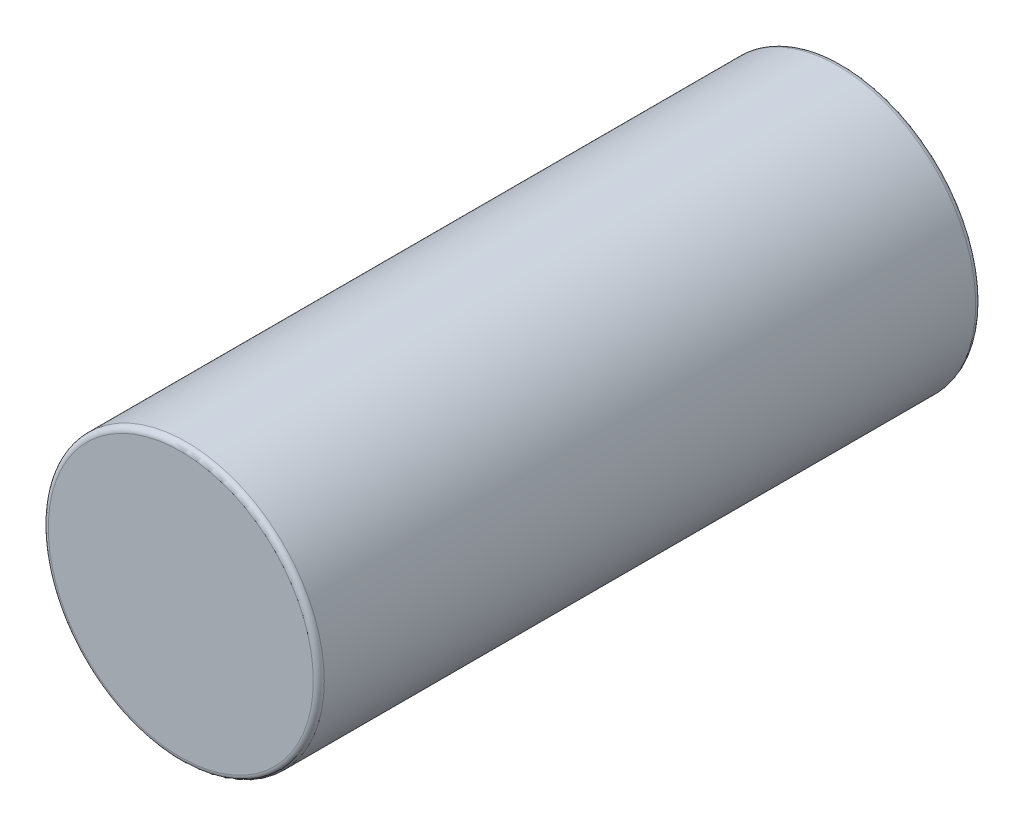
ISO-10303-21;
HEADER;
FILE_DESCRIPTION(('STEP AP214'),'2;1');
FILE_NAME('part.step','',(''),(''),'','','');
FILE_SCHEMA(('AUTOMOTIVE_DESIGN { 1 0 10303 214 1 1 1 1 }'));
ENDSEC;
DATA;
#1=APPLICATION_CONTEXT('core data for automotive mechanical design processes');
#2=APPLICATION_PROTOCOL_DEFINITION('international standard','automotive_design',2000,#1);
#3=PRODUCT_CONTEXT('',#1,'mechanical');
#4=PRODUCT('Part','Part','',(#3));
#5=PRODUCT_RELATED_PRODUCT_CATEGORY('part','',(#4));
#6=PRODUCT_DEFINITION_FORMATION('','',#4);
#7=PRODUCT_DEFINITION_CONTEXT('part definition',#1,'design');
#8=PRODUCT_DEFINITION('design','',#6,#7);
#9=PRODUCT_DEFINITION_SHAPE('','',#8);
#10=(LENGTH_UNIT() NAMED_UNIT(*) SI_UNIT(.MILLI.,.METRE.));
#11=(NAMED_UNIT(*) PLANE_ANGLE_UNIT() SI_UNIT($,.RADIAN.));
#12=(NAMED_UNIT(*) SI_UNIT($,.STERADIAN.) SOLID_ANGLE_UNIT());
#13=UNCERTAINTY_MEASURE_WITH_UNIT(LENGTH_MEASURE(1.E-05),#10,'distance_accuracy_value','');
#14=(GEOMETRIC_REPRESENTATION_CONTEXT(3) GLOBAL_UNCERTAINTY_ASSIGNED_CONTEXT((#13)) GLOBAL_UNIT_ASSIGNED_CONTEXT((#10,
#11,#12)) REPRESENTATION_CONTEXT('',''));
#15=CARTESIAN_POINT('',(0.,0.,0.));
#16=DIRECTION('',(0.,0.,1.));
#17=DIRECTION('',(1.,0.,0.));
#18=AXIS2_PLACEMENT_3D('',#15,#16,#17);
#19=CARTESIAN_POINT('',(0.,0.,-12.));
#20=DIRECTION('',(0.,0.,1.));
#21=DIRECTION('',(1.,0.,0.));
#22=AXIS2_PLACEMENT_3D('',#19,#20,#21);
#23=CYLINDRICAL_SURFACE('',#22,2.5);
#24=CARTESIAN_POINT('',(0.,0.,-11.9));
#25=DIRECTION('',(0.,0.,1.));
#26=DIRECTION('',(1.,0.,0.));
#27=AXIS2_PLACEMENT_3D('',#24,#25,#26);
#28=CIRCLE('',#27,2.5);
#29=CARTESIAN_POINT('',(2.5,0.,-11.9));
#30=VERTEX_POINT('',#29);
#31=EDGE_CURVE('E50',#30,#30,#28,.T.);
#32=ORIENTED_EDGE('',*,*,#31,.T.);
#33=EDGE_LOOP('',(#32));
#34=FACE_BOUND('',#33,.T.);
#35=CARTESIAN_POINT('',(0.,0.,-0.0999999999999994));
#36=DIRECTION('',(0.,0.,1.));
#37=DIRECTION('',(1.,0.,0.));
#38=AXIS2_PLACEMENT_3D('',#35,#36,#37);
#39=CIRCLE('',#38,2.5);
#40=CARTESIAN_POINT('',(2.5,0.,-0.0999999999999994));
#41=VERTEX_POINT('',#40);
#42=EDGE_CURVE('E54',#41,#41,#39,.F.);
#43=ORIENTED_EDGE('',*,*,#42,.T.);
#44=EDGE_LOOP('',(#43));
#45=FACE_BOUND('',#44,.T.);
#46=ADVANCED_FACE('F39',(#34,#45),#23,.T.);
#47=CARTESIAN_POINT('',(0.,0.,-12.));
#48=DIRECTION('',(0.,0.,1.));
#49=DIRECTION('',(1.,0.,0.));
#50=AXIS2_PLACEMENT_3D('',#47,#48,#49);
#51=PLANE('',#50);
#52=CARTESIAN_POINT('',(0.,0.,-12.));
#53=DIRECTION('',(0.,0.,1.));
#54=DIRECTION('',(1.,0.,0.));
#55=AXIS2_PLACEMENT_3D('',#52,#53,#54);
#56=CIRCLE('',#55,2.4);
#57=CARTESIAN_POINT('',(2.4,0.,-12.));
#58=VERTEX_POINT('',#57);
#59=EDGE_CURVE('E46',#58,#58,#56,.F.);
#60=ORIENTED_EDGE('',*,*,#59,.T.);
#61=EDGE_LOOP('',(#60));
#62=FACE_BOUND('',#61,.T.);
#63=ADVANCED_FACE('F70',(#62),#51,.F.);
#64=CARTESIAN_POINT('',(0.,0.,0.));
#65=DIRECTION('',(0.,0.,1.));
#66=DIRECTION('',(1.,0.,0.));
#67=AXIS2_PLACEMENT_3D('',#64,#65,#66);
#68=PLANE('',#67);
#69=CARTESIAN_POINT('',(0.,0.,0.));
#70=DIRECTION('',(0.,0.,1.));
#71=DIRECTION('',(1.,0.,0.));
#72=AXIS2_PLACEMENT_3D('',#69,#70,#71);
#73=CIRCLE('',#72,2.4);
#74=CARTESIAN_POINT('',(2.4,0.,0.));
#75=VERTEX_POINT('',#74);
#76=EDGE_CURVE('E10',#75,#75,#73,.T.);
#77=ORIENTED_EDGE('',*,*,#76,.T.);
#78=EDGE_LOOP('',(#77));
#79=FACE_BOUND('',#78,.T.);
#80=ADVANCED_FACE('F67',(#79),#68,.T.);
#81=CARTESIAN_POINT('',(0.,0.,-11.9));
#82=DIRECTION('',(0.,0.,1.));
#83=DIRECTION('',(1.,0.,0.));
#84=AXIS2_PLACEMENT_3D('',#81,#82,#83);
#85=TOROIDAL_SURFACE('',#84,2.4,0.1);
#86=ORIENTED_EDGE('',*,*,#59,.F.);
#87=EDGE_LOOP('',(#86));
#88=FACE_BOUND('',#87,.T.);
#89=ORIENTED_EDGE('',*,*,#31,.F.);
#90=EDGE_LOOP('',(#89));
#91=FACE_BOUND('',#90,.T.);
#92=ADVANCED_FACE('F63',(#88,#91),#85,.T.);
#93=CARTESIAN_POINT('',(0.,0.,-0.0999999999999994));
#94=DIRECTION('',(0.,0.,1.));
#95=DIRECTION('',(1.,0.,0.));
#96=AXIS2_PLACEMENT_3D('',#93,#94,#95);
#97=TOROIDAL_SURFACE('',#96,2.4,0.1);
#98=ORIENTED_EDGE('',*,*,#42,.F.);
#99=EDGE_LOOP('',(#98));
#100=FACE_BOUND('',#99,.T.);
#101=ORIENTED_EDGE('',*,*,#76,.F.);
#102=EDGE_LOOP('',(#101));
#103=FACE_BOUND('',#102,.T.);
#104=ADVANCED_FACE('F41',(#100,#103),#97,.T.);
#105=CLOSED_SHELL('',(#46,#63,#80,#92,#104));
#106=MANIFOLD_SOLID_BREP('B2',#105);
#107=ADVANCED_BREP_SHAPE_REPRESENTATION('',(#18,#106),#14);
#108=SHAPE_DEFINITION_REPRESENTATION(#9,#107);
ENDSEC;
END-ISO-10303-21;
